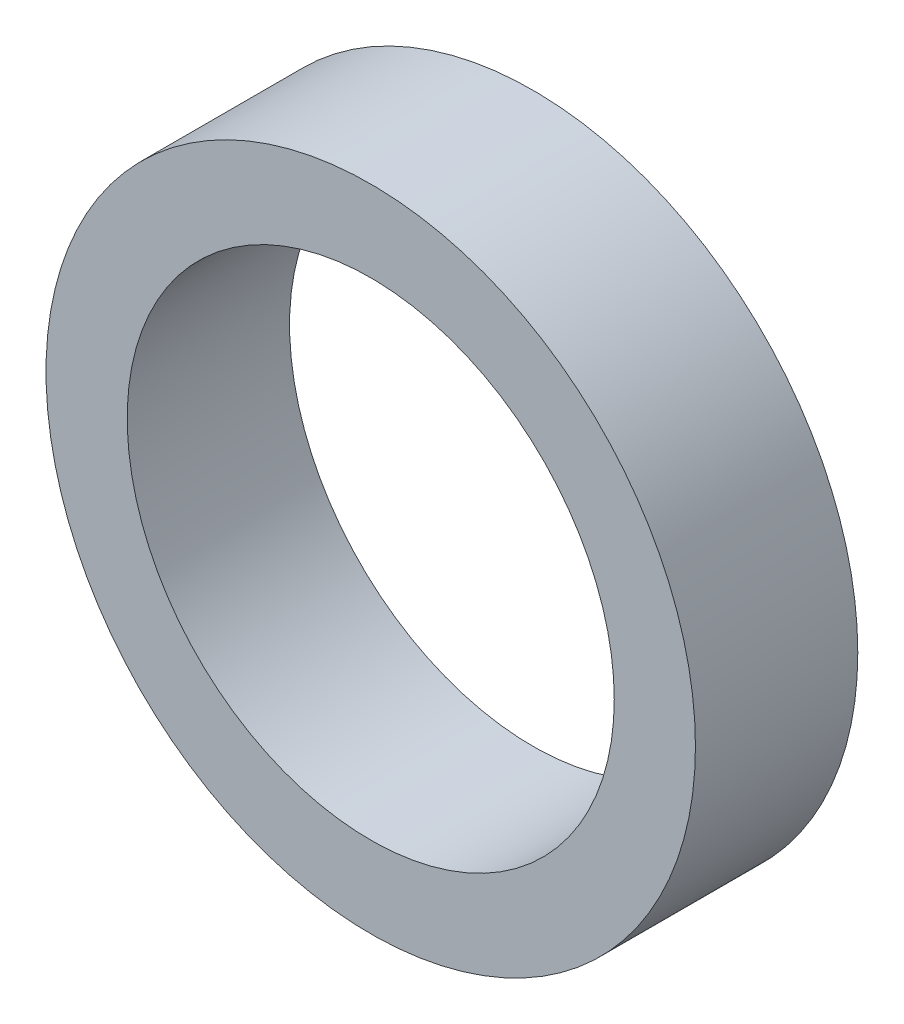
ISO-10303-21;
HEADER;
FILE_DESCRIPTION(('STEP AP214'),'2;1');
FILE_NAME('part.step','',(''),(''),'','','');
FILE_SCHEMA(('AUTOMOTIVE_DESIGN { 1 0 10303 214 1 1 1 1 }'));
ENDSEC;
DATA;
#1=APPLICATION_CONTEXT('core data for automotive mechanical design processes');
#2=APPLICATION_PROTOCOL_DEFINITION('international standard','automotive_design',2000,#1);
#3=PRODUCT_CONTEXT('',#1,'mechanical');
#4=PRODUCT('Part','Part','',(#3));
#5=PRODUCT_RELATED_PRODUCT_CATEGORY('part','',(#4));
#6=PRODUCT_DEFINITION_FORMATION('','',#4);
#7=PRODUCT_DEFINITION_CONTEXT('part definition',#1,'design');
#8=PRODUCT_DEFINITION('design','',#6,#7);
#9=PRODUCT_DEFINITION_SHAPE('','',#8);
#10=(LENGTH_UNIT() NAMED_UNIT(*) SI_UNIT(.MILLI.,.METRE.));
#11=(NAMED_UNIT(*) PLANE_ANGLE_UNIT() SI_UNIT($,.RADIAN.));
#12=(NAMED_UNIT(*) SI_UNIT($,.STERADIAN.) SOLID_ANGLE_UNIT());
#13=UNCERTAINTY_MEASURE_WITH_UNIT(LENGTH_MEASURE(1.E-05),#10,'distance_accuracy_value','');
#14=(GEOMETRIC_REPRESENTATION_CONTEXT(3) GLOBAL_UNCERTAINTY_ASSIGNED_CONTEXT((#13)) GLOBAL_UNIT_ASSIGNED_CONTEXT((#10,
#11,#12)) REPRESENTATION_CONTEXT('',''));
#15=CARTESIAN_POINT('',(0.,0.,0.));
#16=DIRECTION('',(0.,0.,1.));
#17=DIRECTION('',(1.,0.,0.));
#18=AXIS2_PLACEMENT_3D('',#15,#16,#17);
#19=CARTESIAN_POINT('',(0.,0.,3.175));
#20=DIRECTION('',(0.,0.,1.));
#21=DIRECTION('',(1.,0.,0.));
#22=AXIS2_PLACEMENT_3D('',#19,#20,#21);
#23=PLANE('',#22);
#24=CARTESIAN_POINT('',(0.,0.,3.175));
#25=DIRECTION('',(0.,0.,1.));
#26=DIRECTION('',(1.,0.,0.));
#27=AXIS2_PLACEMENT_3D('',#24,#25,#26);
#28=CIRCLE('',#27,6.35);
#29=CARTESIAN_POINT('',(6.35,0.,3.175));
#30=VERTEX_POINT('',#29);
#31=EDGE_CURVE('E10',#30,#30,#28,.T.);
#32=ORIENTED_EDGE('',*,*,#31,.T.);
#33=EDGE_LOOP('',(#32));
#34=FACE_BOUND('',#33,.T.);
#35=CARTESIAN_POINT('',(0.,0.,3.175));
#36=DIRECTION('',(0.,0.,1.));
#37=DIRECTION('',(1.,0.,0.));
#38=AXIS2_PLACEMENT_3D('',#35,#36,#37);
#39=CIRCLE('',#38,4.7625);
#40=CARTESIAN_POINT('',(4.7625,0.,3.175));
#41=VERTEX_POINT('',#40);
#42=EDGE_CURVE('E42',#41,#41,#39,.T.);
#43=ORIENTED_EDGE('',*,*,#42,.F.);
#44=EDGE_LOOP('',(#43));
#45=FACE_BOUND('',#44,.T.);
#46=ADVANCED_FACE('F31',(#34,#45),#23,.T.);
#47=CARTESIAN_POINT('',(0.,0.,0.));
#48=DIRECTION('',(0.,0.,1.));
#49=DIRECTION('',(1.,0.,0.));
#50=AXIS2_PLACEMENT_3D('',#47,#48,#49);
#51=PLANE('',#50);
#52=CARTESIAN_POINT('',(0.,0.,0.));
#53=DIRECTION('',(0.,0.,1.));
#54=DIRECTION('',(1.,0.,0.));
#55=AXIS2_PLACEMENT_3D('',#52,#53,#54);
#56=CIRCLE('',#55,6.35);
#57=CARTESIAN_POINT('',(6.35,0.,0.));
#58=VERTEX_POINT('',#57);
#59=EDGE_CURVE('E35',#58,#58,#56,.T.);
#60=ORIENTED_EDGE('',*,*,#59,.F.);
#61=EDGE_LOOP('',(#60));
#62=FACE_BOUND('',#61,.T.);
#63=CARTESIAN_POINT('',(0.,0.,0.));
#64=DIRECTION('',(0.,0.,1.));
#65=DIRECTION('',(1.,0.,0.));
#66=AXIS2_PLACEMENT_3D('',#63,#64,#65);
#67=CIRCLE('',#66,4.7625);
#68=CARTESIAN_POINT('',(4.7625,0.,0.));
#69=VERTEX_POINT('',#68);
#70=EDGE_CURVE('E44',#69,#69,#67,.T.);
#71=ORIENTED_EDGE('',*,*,#70,.T.);
#72=EDGE_LOOP('',(#71));
#73=FACE_BOUND('',#72,.T.);
#74=ADVANCED_FACE('F54',(#62,#73),#51,.F.);
#75=CARTESIAN_POINT('',(0.,0.,3.175));
#76=DIRECTION('',(0.,0.,-1.));
#77=DIRECTION('',(-1.,0.,0.));
#78=AXIS2_PLACEMENT_3D('',#75,#76,#77);
#79=CYLINDRICAL_SURFACE('',#78,6.35);
#80=ORIENTED_EDGE('',*,*,#31,.F.);
#81=EDGE_LOOP('',(#80));
#82=FACE_BOUND('',#81,.T.);
#83=ORIENTED_EDGE('',*,*,#59,.T.);
#84=EDGE_LOOP('',(#83));
#85=FACE_BOUND('',#84,.T.);
#86=ADVANCED_FACE('F33',(#82,#85),#79,.T.);
#87=CARTESIAN_POINT('',(0.,0.,3.175));
#88=DIRECTION('',(0.,0.,-1.));
#89=DIRECTION('',(-1.,0.,0.));
#90=AXIS2_PLACEMENT_3D('',#87,#88,#89);
#91=CYLINDRICAL_SURFACE('',#90,4.7625);
#92=ORIENTED_EDGE('',*,*,#42,.T.);
#93=EDGE_LOOP('',(#92));
#94=FACE_BOUND('',#93,.T.);
#95=ORIENTED_EDGE('',*,*,#70,.F.);
#96=EDGE_LOOP('',(#95));
#97=FACE_BOUND('',#96,.T.);
#98=ADVANCED_FACE('F50',(#94,#97),#91,.F.);
#99=CLOSED_SHELL('',(#46,#74,#86,#98));
#100=MANIFOLD_SOLID_BREP('B2',#99);
#101=ADVANCED_BREP_SHAPE_REPRESENTATION('',(#18,#100),#14);
#102=SHAPE_DEFINITION_REPRESENTATION(#9,#101);
ENDSEC;
END-ISO-10303-21;
